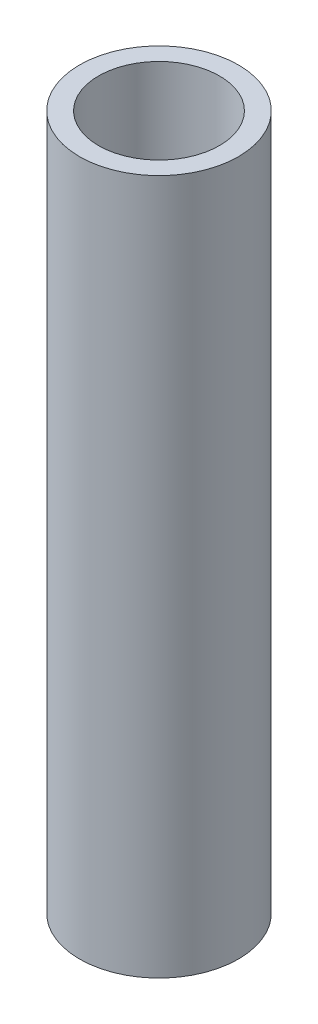
ISO-10303-21;
HEADER;
FILE_DESCRIPTION(('STEP AP214'),'2;1');
FILE_NAME('part.step','',(''),(''),'','','');
FILE_SCHEMA(('AUTOMOTIVE_DESIGN { 1 0 10303 214 1 1 1 1 }'));
ENDSEC;
DATA;
#1=APPLICATION_CONTEXT('core data for automotive mechanical design processes');
#2=APPLICATION_PROTOCOL_DEFINITION('international standard','automotive_design',2000,#1);
#3=PRODUCT_CONTEXT('',#1,'mechanical');
#4=PRODUCT('Part','Part','',(#3));
#5=PRODUCT_RELATED_PRODUCT_CATEGORY('part','',(#4));
#6=PRODUCT_DEFINITION_FORMATION('','',#4);
#7=PRODUCT_DEFINITION_CONTEXT('part definition',#1,'design');
#8=PRODUCT_DEFINITION('design','',#6,#7);
#9=PRODUCT_DEFINITION_SHAPE('','',#8);
#10=(LENGTH_UNIT() NAMED_UNIT(*) SI_UNIT(.MILLI.,.METRE.));
#11=(NAMED_UNIT(*) PLANE_ANGLE_UNIT() SI_UNIT($,.RADIAN.));
#12=(NAMED_UNIT(*) SI_UNIT($,.STERADIAN.) SOLID_ANGLE_UNIT());
#13=UNCERTAINTY_MEASURE_WITH_UNIT(LENGTH_MEASURE(1.E-05),#10,'distance_accuracy_value','');
#14=(GEOMETRIC_REPRESENTATION_CONTEXT(3) GLOBAL_UNCERTAINTY_ASSIGNED_CONTEXT((#13)) GLOBAL_UNIT_ASSIGNED_CONTEXT((#10,
#11,#12)) REPRESENTATION_CONTEXT('',''));
#15=CARTESIAN_POINT('',(0.,0.,0.));
#16=DIRECTION('',(0.,0.,1.));
#17=DIRECTION('',(1.,0.,0.));
#18=AXIS2_PLACEMENT_3D('',#15,#16,#17);
#19=CARTESIAN_POINT('',(0.,146.05,0.));
#20=DIRECTION('',(0.,-1.,0.));
#21=DIRECTION('',(0.,0.,-1.));
#22=AXIS2_PLACEMENT_3D('',#19,#20,#21);
#23=CYLINDRICAL_SURFACE('',#22,12.7);
#24=CARTESIAN_POINT('',(0.,146.05,0.));
#25=DIRECTION('',(0.,1.,0.));
#26=DIRECTION('',(0.,0.,1.));
#27=AXIS2_PLACEMENT_3D('',#24,#25,#26);
#28=CIRCLE('',#27,12.7);
#29=CARTESIAN_POINT('',(0.,146.05,12.7));
#30=VERTEX_POINT('',#29);
#31=EDGE_CURVE('E44',#30,#30,#28,.T.);
#32=ORIENTED_EDGE('',*,*,#31,.T.);
#33=EDGE_LOOP('',(#32));
#34=FACE_BOUND('',#33,.T.);
#35=CARTESIAN_POINT('',(0.,0.,0.));
#36=DIRECTION('',(0.,1.,0.));
#37=DIRECTION('',(0.,0.,1.));
#38=AXIS2_PLACEMENT_3D('',#35,#36,#37);
#39=CIRCLE('',#38,12.7);
#40=CARTESIAN_POINT('',(0.,0.,12.7));
#41=VERTEX_POINT('',#40);
#42=EDGE_CURVE('E50',#41,#41,#39,.T.);
#43=ORIENTED_EDGE('',*,*,#42,.F.);
#44=EDGE_LOOP('',(#43));
#45=FACE_BOUND('',#44,.T.);
#46=ADVANCED_FACE('F37',(#34,#45),#23,.F.);
#47=CARTESIAN_POINT('',(0.,146.05,0.));
#48=DIRECTION('',(0.,-1.,0.));
#49=DIRECTION('',(0.,0.,-1.));
#50=AXIS2_PLACEMENT_3D('',#47,#48,#49);
#51=CYLINDRICAL_SURFACE('',#50,16.7005);
#52=CARTESIAN_POINT('',(0.,146.05,0.));
#53=DIRECTION('',(0.,1.,0.));
#54=DIRECTION('',(0.,0.,1.));
#55=AXIS2_PLACEMENT_3D('',#52,#53,#54);
#56=CIRCLE('',#55,16.7005);
#57=CARTESIAN_POINT('',(0.,146.05,16.7005));
#58=VERTEX_POINT('',#57);
#59=EDGE_CURVE('E10',#58,#58,#56,.T.);
#60=ORIENTED_EDGE('',*,*,#59,.F.);
#61=EDGE_LOOP('',(#60));
#62=FACE_BOUND('',#61,.T.);
#63=CARTESIAN_POINT('',(0.,0.,0.));
#64=DIRECTION('',(0.,1.,0.));
#65=DIRECTION('',(0.,0.,1.));
#66=AXIS2_PLACEMENT_3D('',#63,#64,#65);
#67=CIRCLE('',#66,16.7005);
#68=CARTESIAN_POINT('',(0.,0.,16.7005));
#69=VERTEX_POINT('',#68);
#70=EDGE_CURVE('E40',#69,#69,#67,.T.);
#71=ORIENTED_EDGE('',*,*,#70,.T.);
#72=EDGE_LOOP('',(#71));
#73=FACE_BOUND('',#72,.T.);
#74=ADVANCED_FACE('F57',(#62,#73),#51,.T.);
#75=CARTESIAN_POINT('',(0.,146.05,0.));
#76=DIRECTION('',(0.,1.,0.));
#77=DIRECTION('',(0.,0.,1.));
#78=AXIS2_PLACEMENT_3D('',#75,#76,#77);
#79=PLANE('',#78);
#80=ORIENTED_EDGE('',*,*,#31,.F.);
#81=EDGE_LOOP('',(#80));
#82=FACE_BOUND('',#81,.T.);
#83=ORIENTED_EDGE('',*,*,#59,.T.);
#84=EDGE_LOOP('',(#83));
#85=FACE_BOUND('',#84,.T.);
#86=ADVANCED_FACE('F61',(#82,#85),#79,.T.);
#87=CARTESIAN_POINT('',(0.,0.,0.));
#88=DIRECTION('',(0.,1.,0.));
#89=DIRECTION('',(0.,0.,1.));
#90=AXIS2_PLACEMENT_3D('',#87,#88,#89);
#91=PLANE('',#90);
#92=ORIENTED_EDGE('',*,*,#42,.T.);
#93=EDGE_LOOP('',(#92));
#94=FACE_BOUND('',#93,.T.);
#95=ORIENTED_EDGE('',*,*,#70,.F.);
#96=EDGE_LOOP('',(#95));
#97=FACE_BOUND('',#96,.T.);
#98=ADVANCED_FACE('F59',(#94,#97),#91,.F.);
#99=CLOSED_SHELL('',(#46,#74,#86,#98));
#100=MANIFOLD_SOLID_BREP('B2',#99);
#101=ADVANCED_BREP_SHAPE_REPRESENTATION('',(#18,#100),#14);
#102=SHAPE_DEFINITION_REPRESENTATION(#9,#101);
ENDSEC;
END-ISO-10303-21;
